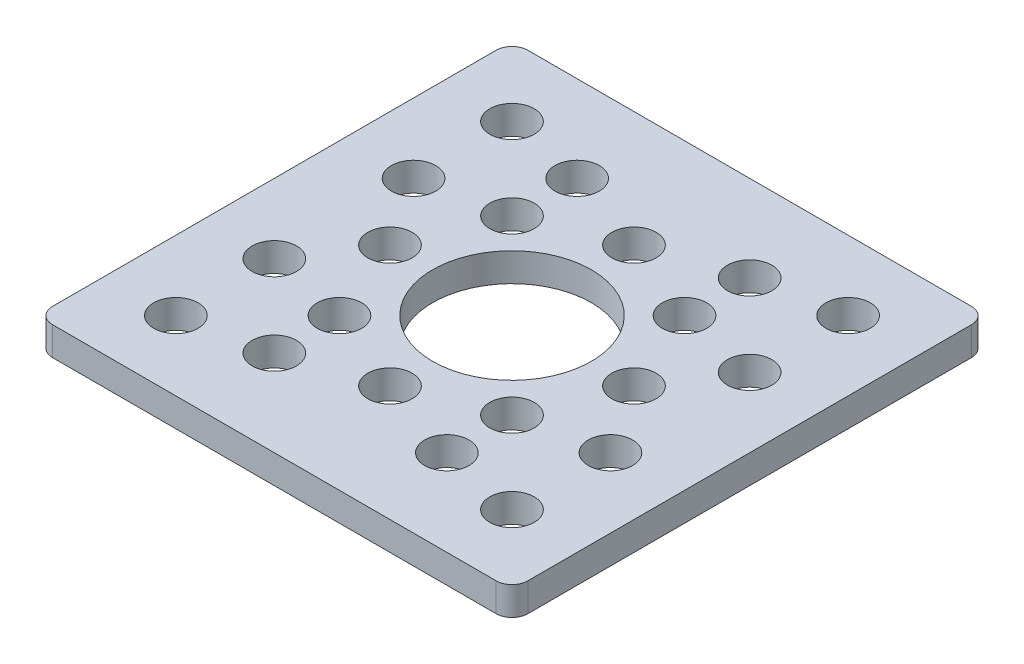
ISO-10303-21;
HEADER;
FILE_DESCRIPTION(('STEP AP214'),'2;1');
FILE_NAME('part.step','',(''),(''),'','','');
FILE_SCHEMA(('AUTOMOTIVE_DESIGN { 1 0 10303 214 1 1 1 1 }'));
ENDSEC;
DATA;
#1=APPLICATION_CONTEXT('core data for automotive mechanical design processes');
#2=APPLICATION_PROTOCOL_DEFINITION('international standard','automotive_design',2000,#1);
#3=PRODUCT_CONTEXT('',#1,'mechanical');
#4=PRODUCT('Part','Part','',(#3));
#5=PRODUCT_RELATED_PRODUCT_CATEGORY('part','',(#4));
#6=PRODUCT_DEFINITION_FORMATION('','',#4);
#7=PRODUCT_DEFINITION_CONTEXT('part definition',#1,'design');
#8=PRODUCT_DEFINITION('design','',#6,#7);
#9=PRODUCT_DEFINITION_SHAPE('','',#8);
#10=(LENGTH_UNIT() NAMED_UNIT(*) SI_UNIT(.MILLI.,.METRE.));
#11=(NAMED_UNIT(*) PLANE_ANGLE_UNIT() SI_UNIT($,.RADIAN.));
#12=(NAMED_UNIT(*) SI_UNIT($,.STERADIAN.) SOLID_ANGLE_UNIT());
#13=UNCERTAINTY_MEASURE_WITH_UNIT(LENGTH_MEASURE(1.E-05),#10,'distance_accuracy_value','');
#14=(GEOMETRIC_REPRESENTATION_CONTEXT(3) GLOBAL_UNCERTAINTY_ASSIGNED_CONTEXT((#13)) GLOBAL_UNIT_ASSIGNED_CONTEXT((#10,
#11,#12)) REPRESENTATION_CONTEXT('',''));
#15=CARTESIAN_POINT('',(0.,0.,0.));
#16=DIRECTION('',(0.,0.,1.));
#17=DIRECTION('',(1.,0.,0.));
#18=AXIS2_PLACEMENT_3D('',#15,#16,#17);
#19=CARTESIAN_POINT('',(0.,0.,0.));
#20=DIRECTION('',(0.,-1.,0.));
#21=DIRECTION('',(0.,0.,-1.));
#22=AXIS2_PLACEMENT_3D('',#19,#20,#21);
#23=PLANE('',#22);
#24=CARTESIAN_POINT('',(-13.4703841816038,0.,13.4703841816037));
#25=DIRECTION('',(0.,1.,0.));
#26=DIRECTION('',(0.,0.,1.));
#27=AXIS2_PLACEMENT_3D('',#24,#25,#26);
#28=CIRCLE('',#27,1.77799999999999);
#29=CARTESIAN_POINT('',(-13.4703841816038,0.,15.2483841816037));
#30=VERTEX_POINT('',#29);
#31=EDGE_CURVE('E192',#30,#30,#28,.T.);
#32=ORIENTED_EDGE('',*,*,#31,.T.);
#33=EDGE_LOOP('',(#32));
#34=FACE_BOUND('',#33,.T.);
#35=CARTESIAN_POINT('',(-13.4703841816037,0.,5.57961581839627));
#36=DIRECTION('',(0.,1.,0.));
#37=DIRECTION('',(0.,0.,1.));
#38=AXIS2_PLACEMENT_3D('',#35,#36,#37);
#39=CIRCLE('',#38,1.77799999999999);
#40=CARTESIAN_POINT('',(-13.4703841816037,0.,7.35761581839627));
#41=VERTEX_POINT('',#40);
#42=EDGE_CURVE('E195',#41,#41,#39,.T.);
#43=ORIENTED_EDGE('',*,*,#42,.T.);
#44=EDGE_LOOP('',(#43));
#45=FACE_BOUND('',#44,.T.);
#46=CARTESIAN_POINT('',(-6.91479721322325,0.,-12.1352027867768));
#47=DIRECTION('',(0.,1.,0.));
#48=DIRECTION('',(0.,0.,1.));
#49=AXIS2_PLACEMENT_3D('',#46,#47,#48);
#50=CIRCLE('',#49,1.77799999999999);
#51=CARTESIAN_POINT('',(-6.91479721322325,0.,-10.3572027867768));
#52=VERTEX_POINT('',#51);
#53=EDGE_CURVE('E198',#52,#52,#50,.T.);
#54=ORIENTED_EDGE('',*,*,#53,.T.);
#55=EDGE_LOOP('',(#54));
#56=FACE_BOUND('',#55,.T.);
#57=CARTESIAN_POINT('',(13.4703841816038,0.,-13.4703841816037));
#58=DIRECTION('',(0.,1.,0.));
#59=DIRECTION('',(0.,0.,1.));
#60=AXIS2_PLACEMENT_3D('',#57,#58,#59);
#61=CIRCLE('',#60,1.77799999999999);
#62=CARTESIAN_POINT('',(13.4703841816038,0.,-11.6923841816037));
#63=VERTEX_POINT('',#62);
#64=EDGE_CURVE('E246',#63,#63,#61,.T.);
#65=ORIENTED_EDGE('',*,*,#64,.T.);
#66=EDGE_LOOP('',(#65));
#67=FACE_BOUND('',#66,.T.);
#68=CARTESIAN_POINT('',(6.91479721322333,0.,6.91479721322316));
#69=DIRECTION('',(0.,1.,0.));
#70=DIRECTION('',(0.,0.,1.));
#71=AXIS2_PLACEMENT_3D('',#68,#69,#70);
#72=CIRCLE('',#71,1.778);
#73=CARTESIAN_POINT('',(6.91479721322333,0.,8.69279721322316));
#74=VERTEX_POINT('',#73);
#75=EDGE_CURVE('E109',#74,#74,#72,.T.);
#76=ORIENTED_EDGE('',*,*,#75,.T.);
#77=EDGE_LOOP('',(#76));
#78=FACE_BOUND('',#77,.T.);
#79=DIRECTION('',(1.,0.,0.));
#80=VECTOR('',#79,1.);
#81=CARTESIAN_POINT('',(-19.05,0.,-19.05));
#82=LINE('',#81,#80);
#83=CARTESIAN_POINT('',(-17.78,0.,-19.05));
#84=VERTEX_POINT('',#83);
#85=CARTESIAN_POINT('',(17.78,0.,-19.05));
#86=VERTEX_POINT('',#85);
#87=EDGE_CURVE('E115',#84,#86,#82,.T.);
#88=ORIENTED_EDGE('',*,*,#87,.T.);
#89=CARTESIAN_POINT('',(17.78,0.,-17.78));
#90=DIRECTION('',(0.,-1.,0.));
#91=DIRECTION('',(0.,0.,-1.));
#92=AXIS2_PLACEMENT_3D('',#89,#90,#91);
#93=CIRCLE('',#92,1.27);
#94=CARTESIAN_POINT('',(19.05,0.,-17.78));
#95=VERTEX_POINT('',#94);
#96=EDGE_CURVE('E116',#95,#86,#93,.F.);
#97=ORIENTED_EDGE('',*,*,#96,.F.);
#98=DIRECTION('',(0.,0.,1.));
#99=VECTOR('',#98,1.);
#100=CARTESIAN_POINT('',(19.05,0.,19.05));
#101=LINE('',#100,#99);
#102=CARTESIAN_POINT('',(19.05,0.,17.78));
#103=VERTEX_POINT('',#102);
#104=EDGE_CURVE('E110',#95,#103,#101,.T.);
#105=ORIENTED_EDGE('',*,*,#104,.T.);
#106=CARTESIAN_POINT('',(17.78,0.,17.78));
#107=DIRECTION('',(0.,-1.,0.));
#108=DIRECTION('',(0.,0.,-1.));
#109=AXIS2_PLACEMENT_3D('',#106,#107,#108);
#110=CIRCLE('',#109,1.27);
#111=CARTESIAN_POINT('',(17.78,0.,19.05));
#112=VERTEX_POINT('',#111);
#113=EDGE_CURVE('E113',#112,#103,#110,.F.);
#114=ORIENTED_EDGE('',*,*,#113,.F.);
#115=DIRECTION('',(-1.,0.,0.));
#116=VECTOR('',#115,1.);
#117=CARTESIAN_POINT('',(-19.05,0.,19.05));
#118=LINE('',#117,#116);
#119=CARTESIAN_POINT('',(-17.78,0.,19.05));
#120=VERTEX_POINT('',#119);
#121=EDGE_CURVE('E86',#112,#120,#118,.T.);
#122=ORIENTED_EDGE('',*,*,#121,.T.);
#123=CARTESIAN_POINT('',(-17.78,0.,17.78));
#124=DIRECTION('',(0.,-1.,0.));
#125=DIRECTION('',(0.,0.,-1.));
#126=AXIS2_PLACEMENT_3D('',#123,#124,#125);
#127=CIRCLE('',#126,1.27);
#128=CARTESIAN_POINT('',(-19.05,0.,17.78));
#129=VERTEX_POINT('',#128);
#130=EDGE_CURVE('E80',#129,#120,#127,.F.);
#131=ORIENTED_EDGE('',*,*,#130,.F.);
#132=DIRECTION('',(0.,0.,-1.));
#133=VECTOR('',#132,1.);
#134=CARTESIAN_POINT('',(-19.05,0.,19.05));
#135=LINE('',#134,#133);
#136=CARTESIAN_POINT('',(-19.05,0.,-17.78));
#137=VERTEX_POINT('',#136);
#138=EDGE_CURVE('E84',#129,#137,#135,.T.);
#139=ORIENTED_EDGE('',*,*,#138,.T.);
#140=CARTESIAN_POINT('',(-17.78,0.,-17.78));
#141=DIRECTION('',(0.,-1.,0.));
#142=DIRECTION('',(0.,0.,-1.));
#143=AXIS2_PLACEMENT_3D('',#140,#141,#142);
#144=CIRCLE('',#143,1.27);
#145=EDGE_CURVE('E99',#84,#137,#144,.F.);
#146=ORIENTED_EDGE('',*,*,#145,.F.);
#147=EDGE_LOOP('',(#88,#97,#105,#114,#122,#131,#139,#146));
#148=FACE_BOUND('',#147,.T.);
#149=CARTESIAN_POINT('',(0.,0.,0.));
#150=DIRECTION('',(0.,1.,0.));
#151=DIRECTION('',(0.,0.,1.));
#152=AXIS2_PLACEMENT_3D('',#149,#150,#151);
#153=CIRCLE('',#152,6.3627);
#154=CARTESIAN_POINT('',(0.,0.,6.3627));
#155=VERTEX_POINT('',#154);
#156=EDGE_CURVE('E92',#155,#155,#153,.T.);
#157=ORIENTED_EDGE('',*,*,#156,.T.);
#158=EDGE_LOOP('',(#157));
#159=FACE_BOUND('',#158,.T.);
#160=CARTESIAN_POINT('',(9.779,0.,0.));
#161=DIRECTION('',(0.,1.,0.));
#162=DIRECTION('',(0.,0.,1.));
#163=AXIS2_PLACEMENT_3D('',#160,#161,#162);
#164=CIRCLE('',#163,1.778);
#165=CARTESIAN_POINT('',(9.779,0.,1.778));
#166=VERTEX_POINT('',#165);
#167=EDGE_CURVE('E210',#166,#166,#164,.T.);
#168=ORIENTED_EDGE('',*,*,#167,.T.);
#169=EDGE_LOOP('',(#168));
#170=FACE_BOUND('',#169,.T.);
#171=CARTESIAN_POINT('',(6.91479721322324,0.,-6.91479721322326));
#172=DIRECTION('',(0.,1.,0.));
#173=DIRECTION('',(0.,0.,1.));
#174=AXIS2_PLACEMENT_3D('',#171,#172,#173);
#175=CIRCLE('',#174,1.778);
#176=CARTESIAN_POINT('',(6.91479721322324,0.,-5.13679721322326));
#177=VERTEX_POINT('',#176);
#178=EDGE_CURVE('E213',#177,#177,#175,.T.);
#179=ORIENTED_EDGE('',*,*,#178,.T.);
#180=EDGE_LOOP('',(#179));
#181=FACE_BOUND('',#180,.T.);
#182=CARTESIAN_POINT('',(0.,0.,-9.779));
#183=DIRECTION('',(0.,1.,0.));
#184=DIRECTION('',(0.,0.,1.));
#185=AXIS2_PLACEMENT_3D('',#182,#183,#184);
#186=CIRCLE('',#185,1.778);
#187=CARTESIAN_POINT('',(0.,0.,-8.001));
#188=VERTEX_POINT('',#187);
#189=EDGE_CURVE('E216',#188,#188,#186,.T.);
#190=ORIENTED_EDGE('',*,*,#189,.T.);
#191=EDGE_LOOP('',(#190));
#192=FACE_BOUND('',#191,.T.);
#193=CARTESIAN_POINT('',(-6.91479721322328,0.,-6.91479721322321));
#194=DIRECTION('',(0.,1.,0.));
#195=DIRECTION('',(0.,0.,1.));
#196=AXIS2_PLACEMENT_3D('',#193,#194,#195);
#197=CIRCLE('',#196,1.778);
#198=CARTESIAN_POINT('',(-6.91479721322328,0.,-5.13679721322321));
#199=VERTEX_POINT('',#198);
#200=EDGE_CURVE('E219',#199,#199,#197,.T.);
#201=ORIENTED_EDGE('',*,*,#200,.T.);
#202=EDGE_LOOP('',(#201));
#203=FACE_BOUND('',#202,.T.);
#204=CARTESIAN_POINT('',(-9.779,0.,0.));
#205=DIRECTION('',(0.,1.,0.));
#206=DIRECTION('',(0.,0.,1.));
#207=AXIS2_PLACEMENT_3D('',#204,#205,#206);
#208=CIRCLE('',#207,1.778);
#209=CARTESIAN_POINT('',(-9.779,0.,1.778));
#210=VERTEX_POINT('',#209);
#211=EDGE_CURVE('E222',#210,#210,#208,.T.);
#212=ORIENTED_EDGE('',*,*,#211,.T.);
#213=EDGE_LOOP('',(#212));
#214=FACE_BOUND('',#213,.T.);
#215=CARTESIAN_POINT('',(-6.91479721322319,0.,6.91479721322331));
#216=DIRECTION('',(0.,1.,0.));
#217=DIRECTION('',(0.,0.,1.));
#218=AXIS2_PLACEMENT_3D('',#215,#216,#217);
#219=CIRCLE('',#218,1.778);
#220=CARTESIAN_POINT('',(-6.91479721322319,0.,8.69279721322331));
#221=VERTEX_POINT('',#220);
#222=EDGE_CURVE('E225',#221,#221,#219,.T.);
#223=ORIENTED_EDGE('',*,*,#222,.T.);
#224=EDGE_LOOP('',(#223));
#225=FACE_BOUND('',#224,.T.);
#226=CARTESIAN_POINT('',(1.02429588037641E-13,0.,9.779));
#227=DIRECTION('',(0.,1.,0.));
#228=DIRECTION('',(0.,0.,1.));
#229=AXIS2_PLACEMENT_3D('',#226,#227,#228);
#230=CIRCLE('',#229,1.778);
#231=CARTESIAN_POINT('',(1.02429588037641E-13,0.,11.557));
#232=VERTEX_POINT('',#231);
#233=EDGE_CURVE('E228',#232,#232,#230,.T.);
#234=ORIENTED_EDGE('',*,*,#233,.T.);
#235=EDGE_LOOP('',(#234));
#236=FACE_BOUND('',#235,.T.);
#237=CARTESIAN_POINT('',(13.4703841816037,0.,5.57961581839627));
#238=DIRECTION('',(0.,1.,0.));
#239=DIRECTION('',(0.,0.,1.));
#240=AXIS2_PLACEMENT_3D('',#237,#238,#239);
#241=CIRCLE('',#240,1.77799999999999);
#242=CARTESIAN_POINT('',(13.4703841816037,0.,7.35761581839627));
#243=VERTEX_POINT('',#242);
#244=EDGE_CURVE('E231',#243,#243,#241,.T.);
#245=ORIENTED_EDGE('',*,*,#244,.T.);
#246=EDGE_LOOP('',(#245));
#247=FACE_BOUND('',#246,.T.);
#248=CARTESIAN_POINT('',(6.91479721322325,0.,12.1352027867768));
#249=DIRECTION('',(0.,1.,0.));
#250=DIRECTION('',(0.,0.,1.));
#251=AXIS2_PLACEMENT_3D('',#248,#249,#250);
#252=CIRCLE('',#251,1.77799999999999);
#253=CARTESIAN_POINT('',(6.91479721322325,0.,13.9132027867767));
#254=VERTEX_POINT('',#253);
#255=EDGE_CURVE('E234',#254,#254,#252,.T.);
#256=ORIENTED_EDGE('',*,*,#255,.T.);
#257=EDGE_LOOP('',(#256));
#258=FACE_BOUND('',#257,.T.);
#259=CARTESIAN_POINT('',(13.4703841816038,0.,13.4703841816037));
#260=DIRECTION('',(0.,1.,0.));
#261=DIRECTION('',(0.,0.,1.));
#262=AXIS2_PLACEMENT_3D('',#259,#260,#261);
#263=CIRCLE('',#262,1.77799999999999);
#264=CARTESIAN_POINT('',(13.4703841816038,0.,15.2483841816037));
#265=VERTEX_POINT('',#264);
#266=EDGE_CURVE('E237',#265,#265,#263,.T.);
#267=ORIENTED_EDGE('',*,*,#266,.T.);
#268=EDGE_LOOP('',(#267));
#269=FACE_BOUND('',#268,.T.);
#270=CARTESIAN_POINT('',(13.4703841816037,0.,-5.57961581839627));
#271=DIRECTION('',(0.,1.,0.));
#272=DIRECTION('',(0.,0.,1.));
#273=AXIS2_PLACEMENT_3D('',#270,#271,#272);
#274=CIRCLE('',#273,1.77799999999999);
#275=CARTESIAN_POINT('',(13.4703841816037,0.,-3.80161581839628));
#276=VERTEX_POINT('',#275);
#277=EDGE_CURVE('E240',#276,#276,#274,.T.);
#278=ORIENTED_EDGE('',*,*,#277,.T.);
#279=EDGE_LOOP('',(#278));
#280=FACE_BOUND('',#279,.T.);
#281=CARTESIAN_POINT('',(6.91479721322325,0.,-12.1352027867768));
#282=DIRECTION('',(0.,1.,0.));
#283=DIRECTION('',(0.,0.,1.));
#284=AXIS2_PLACEMENT_3D('',#281,#282,#283);
#285=CIRCLE('',#284,1.77799999999999);
#286=CARTESIAN_POINT('',(6.91479721322325,0.,-10.3572027867768));
#287=VERTEX_POINT('',#286);
#288=EDGE_CURVE('E243',#287,#287,#285,.T.);
#289=ORIENTED_EDGE('',*,*,#288,.T.);
#290=EDGE_LOOP('',(#289));
#291=FACE_BOUND('',#290,.T.);
#292=CARTESIAN_POINT('',(-13.4703841816037,0.,-5.57961581839627));
#293=DIRECTION('',(0.,1.,0.));
#294=DIRECTION('',(0.,0.,1.));
#295=AXIS2_PLACEMENT_3D('',#292,#293,#294);
#296=CIRCLE('',#295,1.77799999999999);
#297=CARTESIAN_POINT('',(-13.4703841816037,0.,-3.80161581839628));
#298=VERTEX_POINT('',#297);
#299=EDGE_CURVE('E249',#298,#298,#296,.T.);
#300=ORIENTED_EDGE('',*,*,#299,.T.);
#301=EDGE_LOOP('',(#300));
#302=FACE_BOUND('',#301,.T.);
#303=CARTESIAN_POINT('',(-13.4703841816038,0.,-13.4703841816037));
#304=DIRECTION('',(0.,1.,0.));
#305=DIRECTION('',(0.,0.,1.));
#306=AXIS2_PLACEMENT_3D('',#303,#304,#305);
#307=CIRCLE('',#306,1.77799999999999);
#308=CARTESIAN_POINT('',(-13.4703841816038,0.,-11.6923841816037));
#309=VERTEX_POINT('',#308);
#310=EDGE_CURVE('E251',#309,#309,#307,.T.);
#311=ORIENTED_EDGE('',*,*,#310,.T.);
#312=EDGE_LOOP('',(#311));
#313=FACE_BOUND('',#312,.T.);
#314=CARTESIAN_POINT('',(-6.91479721322325,0.,12.1352027867768));
#315=DIRECTION('',(0.,1.,0.));
#316=DIRECTION('',(0.,0.,1.));
#317=AXIS2_PLACEMENT_3D('',#314,#315,#316);
#318=CIRCLE('',#317,1.77799999999999);
#319=CARTESIAN_POINT('',(-6.91479721322325,0.,13.9132027867767));
#320=VERTEX_POINT('',#319);
#321=EDGE_CURVE('E19',#320,#320,#318,.T.);
#322=ORIENTED_EDGE('',*,*,#321,.T.);
#323=EDGE_LOOP('',(#322));
#324=FACE_BOUND('',#323,.T.);
#325=ADVANCED_FACE('F16',(#34,#45,#56,#67,#78,#148,#159,#170,#181,#192,#203,#214,#225,#236,#247,
#258,#269,#280,#291,#302,#313,#324),#23,.T.);
#326=CARTESIAN_POINT('',(-6.91479721322325,2.286,12.1352027867768));
#327=DIRECTION('',(0.,1.,0.));
#328=DIRECTION('',(0.,0.,1.));
#329=AXIS2_PLACEMENT_3D('',#326,#327,#328);
#330=CYLINDRICAL_SURFACE('',#329,1.77799999999999);
#331=ORIENTED_EDGE('',*,*,#321,.F.);
#332=EDGE_LOOP('',(#331));
#333=FACE_BOUND('',#332,.T.);
#334=CARTESIAN_POINT('',(-6.91479721322325,2.286,12.1352027867768));
#335=DIRECTION('',(0.,1.,0.));
#336=DIRECTION('',(0.,0.,1.));
#337=AXIS2_PLACEMENT_3D('',#334,#335,#336);
#338=CIRCLE('',#337,1.77799999999999);
#339=CARTESIAN_POINT('',(-6.91479721322325,2.286,13.9132027867767));
#340=VERTEX_POINT('',#339);
#341=EDGE_CURVE('E189',#340,#340,#338,.T.);
#342=ORIENTED_EDGE('',*,*,#341,.T.);
#343=EDGE_LOOP('',(#342));
#344=FACE_BOUND('',#343,.T.);
#345=ADVANCED_FACE('F259',(#333,#344),#330,.F.);
#346=CARTESIAN_POINT('',(-13.4703841816038,2.286,-13.4703841816037));
#347=DIRECTION('',(0.,1.,0.));
#348=DIRECTION('',(0.,0.,1.));
#349=AXIS2_PLACEMENT_3D('',#346,#347,#348);
#350=CYLINDRICAL_SURFACE('',#349,1.77799999999999);
#351=ORIENTED_EDGE('',*,*,#310,.F.);
#352=EDGE_LOOP('',(#351));
#353=FACE_BOUND('',#352,.T.);
#354=CARTESIAN_POINT('',(-13.4703841816038,2.286,-13.4703841816037));
#355=DIRECTION('',(0.,1.,0.));
#356=DIRECTION('',(0.,0.,1.));
#357=AXIS2_PLACEMENT_3D('',#354,#355,#356);
#358=CIRCLE('',#357,1.77799999999999);
#359=CARTESIAN_POINT('',(-13.4703841816038,2.286,-11.6923841816037));
#360=VERTEX_POINT('',#359);
#361=EDGE_CURVE('E186',#360,#360,#358,.T.);
#362=ORIENTED_EDGE('',*,*,#361,.T.);
#363=EDGE_LOOP('',(#362));
#364=FACE_BOUND('',#363,.T.);
#365=ADVANCED_FACE('F262',(#353,#364),#350,.F.);
#366=CARTESIAN_POINT('',(-13.4703841816037,2.286,-5.57961581839627));
#367=DIRECTION('',(0.,1.,0.));
#368=DIRECTION('',(0.,0.,1.));
#369=AXIS2_PLACEMENT_3D('',#366,#367,#368);
#370=CYLINDRICAL_SURFACE('',#369,1.77799999999999);
#371=ORIENTED_EDGE('',*,*,#299,.F.);
#372=EDGE_LOOP('',(#371));
#373=FACE_BOUND('',#372,.T.);
#374=CARTESIAN_POINT('',(-13.4703841816037,2.286,-5.57961581839627));
#375=DIRECTION('',(0.,1.,0.));
#376=DIRECTION('',(0.,0.,1.));
#377=AXIS2_PLACEMENT_3D('',#374,#375,#376);
#378=CIRCLE('',#377,1.77799999999999);
#379=CARTESIAN_POINT('',(-13.4703841816037,2.286,-3.80161581839628));
#380=VERTEX_POINT('',#379);
#381=EDGE_CURVE('E183',#380,#380,#378,.T.);
#382=ORIENTED_EDGE('',*,*,#381,.T.);
#383=EDGE_LOOP('',(#382));
#384=FACE_BOUND('',#383,.T.);
#385=ADVANCED_FACE('F373',(#373,#384),#370,.F.);
#386=CARTESIAN_POINT('',(13.4703841816038,2.286,-13.4703841816037));
#387=DIRECTION('',(0.,1.,0.));
#388=DIRECTION('',(0.,0.,1.));
#389=AXIS2_PLACEMENT_3D('',#386,#387,#388);
#390=CYLINDRICAL_SURFACE('',#389,1.77799999999999);
#391=ORIENTED_EDGE('',*,*,#64,.F.);
#392=EDGE_LOOP('',(#391));
#393=FACE_BOUND('',#392,.T.);
#394=CARTESIAN_POINT('',(13.4703841816038,2.286,-13.4703841816037));
#395=DIRECTION('',(0.,1.,0.));
#396=DIRECTION('',(0.,0.,1.));
#397=AXIS2_PLACEMENT_3D('',#394,#395,#396);
#398=CIRCLE('',#397,1.77799999999999);
#399=CARTESIAN_POINT('',(13.4703841816038,2.286,-11.6923841816037));
#400=VERTEX_POINT('',#399);
#401=EDGE_CURVE('E180',#400,#400,#398,.T.);
#402=ORIENTED_EDGE('',*,*,#401,.T.);
#403=EDGE_LOOP('',(#402));
#404=FACE_BOUND('',#403,.T.);
#405=ADVANCED_FACE('F369',(#393,#404),#390,.F.);
#406=CARTESIAN_POINT('',(6.91479721322325,2.286,-12.1352027867768));
#407=DIRECTION('',(0.,1.,0.));
#408=DIRECTION('',(0.,0.,1.));
#409=AXIS2_PLACEMENT_3D('',#406,#407,#408);
#410=CYLINDRICAL_SURFACE('',#409,1.77799999999999);
#411=ORIENTED_EDGE('',*,*,#288,.F.);
#412=EDGE_LOOP('',(#411));
#413=FACE_BOUND('',#412,.T.);
#414=CARTESIAN_POINT('',(6.91479721322325,2.286,-12.1352027867768));
#415=DIRECTION('',(0.,1.,0.));
#416=DIRECTION('',(0.,0.,1.));
#417=AXIS2_PLACEMENT_3D('',#414,#415,#416);
#418=CIRCLE('',#417,1.77799999999999);
#419=CARTESIAN_POINT('',(6.91479721322325,2.286,-10.3572027867768));
#420=VERTEX_POINT('',#419);
#421=EDGE_CURVE('E177',#420,#420,#418,.T.);
#422=ORIENTED_EDGE('',*,*,#421,.T.);
#423=EDGE_LOOP('',(#422));
#424=FACE_BOUND('',#423,.T.);
#425=ADVANCED_FACE('F365',(#413,#424),#410,.F.);
#426=CARTESIAN_POINT('',(13.4703841816037,2.286,-5.57961581839627));
#427=DIRECTION('',(0.,1.,0.));
#428=DIRECTION('',(0.,0.,1.));
#429=AXIS2_PLACEMENT_3D('',#426,#427,#428);
#430=CYLINDRICAL_SURFACE('',#429,1.77799999999999);
#431=ORIENTED_EDGE('',*,*,#277,.F.);
#432=EDGE_LOOP('',(#431));
#433=FACE_BOUND('',#432,.T.);
#434=CARTESIAN_POINT('',(13.4703841816037,2.286,-5.57961581839627));
#435=DIRECTION('',(0.,1.,0.));
#436=DIRECTION('',(0.,0.,1.));
#437=AXIS2_PLACEMENT_3D('',#434,#435,#436);
#438=CIRCLE('',#437,1.77799999999999);
#439=CARTESIAN_POINT('',(13.4703841816037,2.286,-3.80161581839628));
#440=VERTEX_POINT('',#439);
#441=EDGE_CURVE('E174',#440,#440,#438,.T.);
#442=ORIENTED_EDGE('',*,*,#441,.T.);
#443=EDGE_LOOP('',(#442));
#444=FACE_BOUND('',#443,.T.);
#445=ADVANCED_FACE('F361',(#433,#444),#430,.F.);
#446=CARTESIAN_POINT('',(13.4703841816038,2.286,13.4703841816037));
#447=DIRECTION('',(0.,1.,0.));
#448=DIRECTION('',(0.,0.,1.));
#449=AXIS2_PLACEMENT_3D('',#446,#447,#448);
#450=CYLINDRICAL_SURFACE('',#449,1.77799999999999);
#451=ORIENTED_EDGE('',*,*,#266,.F.);
#452=EDGE_LOOP('',(#451));
#453=FACE_BOUND('',#452,.T.);
#454=CARTESIAN_POINT('',(13.4703841816038,2.286,13.4703841816037));
#455=DIRECTION('',(0.,1.,0.));
#456=DIRECTION('',(0.,0.,1.));
#457=AXIS2_PLACEMENT_3D('',#454,#455,#456);
#458=CIRCLE('',#457,1.77799999999999);
#459=CARTESIAN_POINT('',(13.4703841816038,2.286,15.2483841816037));
#460=VERTEX_POINT('',#459);
#461=EDGE_CURVE('E171',#460,#460,#458,.T.);
#462=ORIENTED_EDGE('',*,*,#461,.T.);
#463=EDGE_LOOP('',(#462));
#464=FACE_BOUND('',#463,.T.);
#465=ADVANCED_FACE('F357',(#453,#464),#450,.F.);
#466=CARTESIAN_POINT('',(6.91479721322325,2.286,12.1352027867768));
#467=DIRECTION('',(0.,1.,0.));
#468=DIRECTION('',(0.,0.,1.));
#469=AXIS2_PLACEMENT_3D('',#466,#467,#468);
#470=CYLINDRICAL_SURFACE('',#469,1.77799999999999);
#471=ORIENTED_EDGE('',*,*,#255,.F.);
#472=EDGE_LOOP('',(#471));
#473=FACE_BOUND('',#472,.T.);
#474=CARTESIAN_POINT('',(6.91479721322325,2.286,12.1352027867768));
#475=DIRECTION('',(0.,1.,0.));
#476=DIRECTION('',(0.,0.,1.));
#477=AXIS2_PLACEMENT_3D('',#474,#475,#476);
#478=CIRCLE('',#477,1.77799999999999);
#479=CARTESIAN_POINT('',(6.91479721322325,2.286,13.9132027867767));
#480=VERTEX_POINT('',#479);
#481=EDGE_CURVE('E168',#480,#480,#478,.T.);
#482=ORIENTED_EDGE('',*,*,#481,.T.);
#483=EDGE_LOOP('',(#482));
#484=FACE_BOUND('',#483,.T.);
#485=ADVANCED_FACE('F353',(#473,#484),#470,.F.);
#486=CARTESIAN_POINT('',(13.4703841816037,2.286,5.57961581839627));
#487=DIRECTION('',(0.,1.,0.));
#488=DIRECTION('',(0.,0.,1.));
#489=AXIS2_PLACEMENT_3D('',#486,#487,#488);
#490=CYLINDRICAL_SURFACE('',#489,1.77799999999999);
#491=ORIENTED_EDGE('',*,*,#244,.F.);
#492=EDGE_LOOP('',(#491));
#493=FACE_BOUND('',#492,.T.);
#494=CARTESIAN_POINT('',(13.4703841816037,2.286,5.57961581839627));
#495=DIRECTION('',(0.,1.,0.));
#496=DIRECTION('',(0.,0.,1.));
#497=AXIS2_PLACEMENT_3D('',#494,#495,#496);
#498=CIRCLE('',#497,1.77799999999999);
#499=CARTESIAN_POINT('',(13.4703841816037,2.286,7.35761581839627));
#500=VERTEX_POINT('',#499);
#501=EDGE_CURVE('E165',#500,#500,#498,.T.);
#502=ORIENTED_EDGE('',*,*,#501,.T.);
#503=EDGE_LOOP('',(#502));
#504=FACE_BOUND('',#503,.T.);
#505=ADVANCED_FACE('F349',(#493,#504),#490,.F.);
#506=CARTESIAN_POINT('',(1.02429588037641E-13,2.286,9.779));
#507=DIRECTION('',(0.,1.,0.));
#508=DIRECTION('',(0.,0.,1.));
#509=AXIS2_PLACEMENT_3D('',#506,#507,#508);
#510=CYLINDRICAL_SURFACE('',#509,1.778);
#511=ORIENTED_EDGE('',*,*,#233,.F.);
#512=EDGE_LOOP('',(#511));
#513=FACE_BOUND('',#512,.T.);
#514=CARTESIAN_POINT('',(1.02429588037641E-13,2.286,9.779));
#515=DIRECTION('',(0.,1.,0.));
#516=DIRECTION('',(0.,0.,1.));
#517=AXIS2_PLACEMENT_3D('',#514,#515,#516);
#518=CIRCLE('',#517,1.778);
#519=CARTESIAN_POINT('',(1.02429588037641E-13,2.286,11.557));
#520=VERTEX_POINT('',#519);
#521=EDGE_CURVE('E162',#520,#520,#518,.T.);
#522=ORIENTED_EDGE('',*,*,#521,.T.);
#523=EDGE_LOOP('',(#522));
#524=FACE_BOUND('',#523,.T.);
#525=ADVANCED_FACE('F345',(#513,#524),#510,.F.);
#526=CARTESIAN_POINT('',(-6.91479721322319,2.286,6.91479721322331));
#527=DIRECTION('',(0.,1.,0.));
#528=DIRECTION('',(0.,0.,1.));
#529=AXIS2_PLACEMENT_3D('',#526,#527,#528);
#530=CYLINDRICAL_SURFACE('',#529,1.778);
#531=ORIENTED_EDGE('',*,*,#222,.F.);
#532=EDGE_LOOP('',(#531));
#533=FACE_BOUND('',#532,.T.);
#534=CARTESIAN_POINT('',(-6.91479721322319,2.286,6.91479721322331));
#535=DIRECTION('',(0.,1.,0.));
#536=DIRECTION('',(0.,0.,1.));
#537=AXIS2_PLACEMENT_3D('',#534,#535,#536);
#538=CIRCLE('',#537,1.778);
#539=CARTESIAN_POINT('',(-6.91479721322319,2.286,8.69279721322331));
#540=VERTEX_POINT('',#539);
#541=EDGE_CURVE('E159',#540,#540,#538,.T.);
#542=ORIENTED_EDGE('',*,*,#541,.T.);
#543=EDGE_LOOP('',(#542));
#544=FACE_BOUND('',#543,.T.);
#545=ADVANCED_FACE('F341',(#533,#544),#530,.F.);
#546=CARTESIAN_POINT('',(-9.779,2.286,0.));
#547=DIRECTION('',(0.,1.,0.));
#548=DIRECTION('',(0.,0.,1.));
#549=AXIS2_PLACEMENT_3D('',#546,#547,#548);
#550=CYLINDRICAL_SURFACE('',#549,1.778);
#551=ORIENTED_EDGE('',*,*,#211,.F.);
#552=EDGE_LOOP('',(#551));
#553=FACE_BOUND('',#552,.T.);
#554=CARTESIAN_POINT('',(-9.779,2.286,0.));
#555=DIRECTION('',(0.,1.,0.));
#556=DIRECTION('',(0.,0.,1.));
#557=AXIS2_PLACEMENT_3D('',#554,#555,#556);
#558=CIRCLE('',#557,1.778);
#559=CARTESIAN_POINT('',(-9.779,2.286,1.778));
#560=VERTEX_POINT('',#559);
#561=EDGE_CURVE('E156',#560,#560,#558,.T.);
#562=ORIENTED_EDGE('',*,*,#561,.T.);
#563=EDGE_LOOP('',(#562));
#564=FACE_BOUND('',#563,.T.);
#565=ADVANCED_FACE('F337',(#553,#564),#550,.F.);
#566=CARTESIAN_POINT('',(-6.91479721322328,2.286,-6.91479721322321));
#567=DIRECTION('',(0.,1.,0.));
#568=DIRECTION('',(0.,0.,1.));
#569=AXIS2_PLACEMENT_3D('',#566,#567,#568);
#570=CYLINDRICAL_SURFACE('',#569,1.778);
#571=ORIENTED_EDGE('',*,*,#200,.F.);
#572=EDGE_LOOP('',(#571));
#573=FACE_BOUND('',#572,.T.);
#574=CARTESIAN_POINT('',(-6.91479721322328,2.286,-6.91479721322321));
#575=DIRECTION('',(0.,1.,0.));
#576=DIRECTION('',(0.,0.,1.));
#577=AXIS2_PLACEMENT_3D('',#574,#575,#576);
#578=CIRCLE('',#577,1.778);
#579=CARTESIAN_POINT('',(-6.91479721322328,2.286,-5.13679721322321));
#580=VERTEX_POINT('',#579);
#581=EDGE_CURVE('E153',#580,#580,#578,.T.);
#582=ORIENTED_EDGE('',*,*,#581,.T.);
#583=EDGE_LOOP('',(#582));
#584=FACE_BOUND('',#583,.T.);
#585=ADVANCED_FACE('F333',(#573,#584),#570,.F.);
#586=CARTESIAN_POINT('',(0.,2.286,-9.779));
#587=DIRECTION('',(0.,1.,0.));
#588=DIRECTION('',(0.,0.,1.));
#589=AXIS2_PLACEMENT_3D('',#586,#587,#588);
#590=CYLINDRICAL_SURFACE('',#589,1.778);
#591=ORIENTED_EDGE('',*,*,#189,.F.);
#592=EDGE_LOOP('',(#591));
#593=FACE_BOUND('',#592,.T.);
#594=CARTESIAN_POINT('',(0.,2.286,-9.779));
#595=DIRECTION('',(0.,1.,0.));
#596=DIRECTION('',(0.,0.,1.));
#597=AXIS2_PLACEMENT_3D('',#594,#595,#596);
#598=CIRCLE('',#597,1.778);
#599=CARTESIAN_POINT('',(0.,2.286,-8.001));
#600=VERTEX_POINT('',#599);
#601=EDGE_CURVE('E150',#600,#600,#598,.T.);
#602=ORIENTED_EDGE('',*,*,#601,.T.);
#603=EDGE_LOOP('',(#602));
#604=FACE_BOUND('',#603,.T.);
#605=ADVANCED_FACE('F329',(#593,#604),#590,.F.);
#606=CARTESIAN_POINT('',(6.91479721322324,2.286,-6.91479721322326));
#607=DIRECTION('',(0.,1.,0.));
#608=DIRECTION('',(0.,0.,1.));
#609=AXIS2_PLACEMENT_3D('',#606,#607,#608);
#610=CYLINDRICAL_SURFACE('',#609,1.778);
#611=ORIENTED_EDGE('',*,*,#178,.F.);
#612=EDGE_LOOP('',(#611));
#613=FACE_BOUND('',#612,.T.);
#614=CARTESIAN_POINT('',(6.91479721322324,2.286,-6.91479721322326));
#615=DIRECTION('',(0.,1.,0.));
#616=DIRECTION('',(0.,0.,1.));
#617=AXIS2_PLACEMENT_3D('',#614,#615,#616);
#618=CIRCLE('',#617,1.778);
#619=CARTESIAN_POINT('',(6.91479721322324,2.286,-5.13679721322326));
#620=VERTEX_POINT('',#619);
#621=EDGE_CURVE('E147',#620,#620,#618,.T.);
#622=ORIENTED_EDGE('',*,*,#621,.T.);
#623=EDGE_LOOP('',(#622));
#624=FACE_BOUND('',#623,.T.);
#625=ADVANCED_FACE('F325',(#613,#624),#610,.F.);
#626=CARTESIAN_POINT('',(9.779,2.286,0.));
#627=DIRECTION('',(0.,1.,0.));
#628=DIRECTION('',(0.,0.,1.));
#629=AXIS2_PLACEMENT_3D('',#626,#627,#628);
#630=CYLINDRICAL_SURFACE('',#629,1.778);
#631=ORIENTED_EDGE('',*,*,#167,.F.);
#632=EDGE_LOOP('',(#631));
#633=FACE_BOUND('',#632,.T.);
#634=CARTESIAN_POINT('',(9.779,2.286,0.));
#635=DIRECTION('',(0.,1.,0.));
#636=DIRECTION('',(0.,0.,1.));
#637=AXIS2_PLACEMENT_3D('',#634,#635,#636);
#638=CIRCLE('',#637,1.778);
#639=CARTESIAN_POINT('',(9.779,2.286,1.778));
#640=VERTEX_POINT('',#639);
#641=EDGE_CURVE('E144',#640,#640,#638,.T.);
#642=ORIENTED_EDGE('',*,*,#641,.T.);
#643=EDGE_LOOP('',(#642));
#644=FACE_BOUND('',#643,.T.);
#645=ADVANCED_FACE('F321',(#633,#644),#630,.F.);
#646=CARTESIAN_POINT('',(0.,2.286,0.));
#647=DIRECTION('',(0.,1.,0.));
#648=DIRECTION('',(0.,0.,1.));
#649=AXIS2_PLACEMENT_3D('',#646,#647,#648);
#650=CYLINDRICAL_SURFACE('',#649,6.3627);
#651=ORIENTED_EDGE('',*,*,#156,.F.);
#652=EDGE_LOOP('',(#651));
#653=FACE_BOUND('',#652,.T.);
#654=CARTESIAN_POINT('',(0.,2.286,0.));
#655=DIRECTION('',(0.,1.,0.));
#656=DIRECTION('',(0.,0.,1.));
#657=AXIS2_PLACEMENT_3D('',#654,#655,#656);
#658=CIRCLE('',#657,6.3627);
#659=CARTESIAN_POINT('',(0.,2.286,6.3627));
#660=VERTEX_POINT('',#659);
#661=EDGE_CURVE('E141',#660,#660,#658,.T.);
#662=ORIENTED_EDGE('',*,*,#661,.T.);
#663=EDGE_LOOP('',(#662));
#664=FACE_BOUND('',#663,.T.);
#665=ADVANCED_FACE('F318',(#653,#664),#650,.F.);
#666=CARTESIAN_POINT('',(-17.78,2.286,17.78));
#667=DIRECTION('',(0.,-1.,0.));
#668=DIRECTION('',(0.,0.,-1.));
#669=AXIS2_PLACEMENT_3D('',#666,#667,#668);
#670=CYLINDRICAL_SURFACE('',#669,1.27);
#671=ORIENTED_EDGE('',*,*,#130,.T.);
#672=DIRECTION('',(0.,1.,0.));
#673=VECTOR('',#672,1.);
#674=CARTESIAN_POINT('',(-17.78,2.286,19.05));
#675=LINE('',#674,#673);
#676=CARTESIAN_POINT('',(-17.78,2.286,19.05));
#677=VERTEX_POINT('',#676);
#678=EDGE_CURVE('E679',#120,#677,#675,.T.);
#679=ORIENTED_EDGE('',*,*,#678,.T.);
#680=CARTESIAN_POINT('',(-17.78,2.286,17.78));
#681=DIRECTION('',(0.,-1.,0.));
#682=DIRECTION('',(0.,0.,-1.));
#683=AXIS2_PLACEMENT_3D('',#680,#681,#682);
#684=CIRCLE('',#683,1.27);
#685=CARTESIAN_POINT('',(-19.05,2.286,17.78));
#686=VERTEX_POINT('',#685);
#687=EDGE_CURVE('E103',#677,#686,#684,.T.);
#688=ORIENTED_EDGE('',*,*,#687,.T.);
#689=DIRECTION('',(0.,1.,0.));
#690=VECTOR('',#689,1.);
#691=CARTESIAN_POINT('',(-19.05,2.286,17.78));
#692=LINE('',#691,#690);
#693=EDGE_CURVE('E91',#686,#129,#692,.F.);
#694=ORIENTED_EDGE('',*,*,#693,.T.);
#695=EDGE_LOOP('',(#671,#679,#688,#694));
#696=FACE_BOUND('',#695,.T.);
#697=ADVANCED_FACE('F102',(#696),#670,.T.);
#698=CARTESIAN_POINT('',(-19.05,2.286,19.05));
#699=DIRECTION('',(1.,0.,0.));
#700=DIRECTION('',(0.,0.,-1.));
#701=AXIS2_PLACEMENT_3D('',#698,#699,#700);
#702=PLANE('',#701);
#703=ORIENTED_EDGE('',*,*,#693,.F.);
#704=DIRECTION('',(0.,0.,-1.));
#705=VECTOR('',#704,1.);
#706=CARTESIAN_POINT('',(-19.05,2.286,0.));
#707=LINE('',#706,#705);
#708=CARTESIAN_POINT('',(-19.05,2.286,-17.78));
#709=VERTEX_POINT('',#708);
#710=EDGE_CURVE('E139',#686,#709,#707,.T.);
#711=ORIENTED_EDGE('',*,*,#710,.T.);
#712=DIRECTION('',(0.,-1.,0.));
#713=VECTOR('',#712,1.);
#714=CARTESIAN_POINT('',(-19.05,2.286,-17.78));
#715=LINE('',#714,#713);
#716=EDGE_CURVE('E98',#137,#709,#715,.F.);
#717=ORIENTED_EDGE('',*,*,#716,.F.);
#718=ORIENTED_EDGE('',*,*,#138,.F.);
#719=EDGE_LOOP('',(#703,#711,#717,#718));
#720=FACE_BOUND('',#719,.T.);
#721=ADVANCED_FACE('F95',(#720),#702,.F.);
#722=CARTESIAN_POINT('',(-17.78,2.286,-17.78));
#723=DIRECTION('',(0.,-1.,0.));
#724=DIRECTION('',(0.,0.,-1.));
#725=AXIS2_PLACEMENT_3D('',#722,#723,#724);
#726=CYLINDRICAL_SURFACE('',#725,1.27);
#727=ORIENTED_EDGE('',*,*,#145,.T.);
#728=ORIENTED_EDGE('',*,*,#716,.T.);
#729=CARTESIAN_POINT('',(-17.78,2.286,-17.78));
#730=DIRECTION('',(0.,-1.,0.));
#731=DIRECTION('',(0.,0.,-1.));
#732=AXIS2_PLACEMENT_3D('',#729,#730,#731);
#733=CIRCLE('',#732,1.27);
#734=CARTESIAN_POINT('',(-17.78,2.286,-19.05));
#735=VERTEX_POINT('',#734);
#736=EDGE_CURVE('E136',#709,#735,#733,.T.);
#737=ORIENTED_EDGE('',*,*,#736,.T.);
#738=DIRECTION('',(0.,1.,0.));
#739=VECTOR('',#738,1.);
#740=CARTESIAN_POINT('',(-17.78,2.286,-19.05));
#741=LINE('',#740,#739);
#742=EDGE_CURVE('E117',#735,#84,#741,.F.);
#743=ORIENTED_EDGE('',*,*,#742,.T.);
#744=EDGE_LOOP('',(#727,#728,#737,#743));
#745=FACE_BOUND('',#744,.T.);
#746=ADVANCED_FACE('F309',(#745),#726,.T.);
#747=CARTESIAN_POINT('',(-19.05,2.286,-19.05));
#748=DIRECTION('',(0.,0.,1.));
#749=DIRECTION('',(1.,0.,0.));
#750=AXIS2_PLACEMENT_3D('',#747,#748,#749);
#751=PLANE('',#750);
#752=DIRECTION('',(0.,-1.,0.));
#753=VECTOR('',#752,1.);
#754=CARTESIAN_POINT('',(17.78,2.286,-19.05));
#755=LINE('',#754,#753);
#756=CARTESIAN_POINT('',(17.78,2.286,-19.05));
#757=VERTEX_POINT('',#756);
#758=EDGE_CURVE('E206',#86,#757,#755,.F.);
#759=ORIENTED_EDGE('',*,*,#758,.F.);
#760=ORIENTED_EDGE('',*,*,#87,.F.);
#761=ORIENTED_EDGE('',*,*,#742,.F.);
#762=DIRECTION('',(1.,0.,0.));
#763=VECTOR('',#762,1.);
#764=CARTESIAN_POINT('',(0.,2.286,-19.05));
#765=LINE('',#764,#763);
#766=EDGE_CURVE('E135',#735,#757,#765,.T.);
#767=ORIENTED_EDGE('',*,*,#766,.T.);
#768=EDGE_LOOP('',(#759,#760,#761,#767));
#769=FACE_BOUND('',#768,.T.);
#770=ADVANCED_FACE('F305',(#769),#751,.F.);
#771=CARTESIAN_POINT('',(17.78,2.286,-17.78));
#772=DIRECTION('',(0.,-1.,0.));
#773=DIRECTION('',(0.,0.,-1.));
#774=AXIS2_PLACEMENT_3D('',#771,#772,#773);
#775=CYLINDRICAL_SURFACE('',#774,1.27);
#776=ORIENTED_EDGE('',*,*,#96,.T.);
#777=ORIENTED_EDGE('',*,*,#758,.T.);
#778=CARTESIAN_POINT('',(17.78,2.286,-17.78));
#779=DIRECTION('',(0.,-1.,0.));
#780=DIRECTION('',(0.,0.,-1.));
#781=AXIS2_PLACEMENT_3D('',#778,#779,#780);
#782=CIRCLE('',#781,1.27);
#783=CARTESIAN_POINT('',(19.05,2.286,-17.78));
#784=VERTEX_POINT('',#783);
#785=EDGE_CURVE('E132',#757,#784,#782,.T.);
#786=ORIENTED_EDGE('',*,*,#785,.T.);
#787=DIRECTION('',(0.,1.,0.));
#788=VECTOR('',#787,1.);
#789=CARTESIAN_POINT('',(19.05,2.286,-17.78));
#790=LINE('',#789,#788);
#791=EDGE_CURVE('E114',#784,#95,#790,.F.);
#792=ORIENTED_EDGE('',*,*,#791,.T.);
#793=EDGE_LOOP('',(#776,#777,#786,#792));
#794=FACE_BOUND('',#793,.T.);
#795=ADVANCED_FACE('F301',(#794),#775,.T.);
#796=CARTESIAN_POINT('',(19.05,2.286,19.05));
#797=DIRECTION('',(-1.,0.,0.));
#798=DIRECTION('',(0.,0.,1.));
#799=AXIS2_PLACEMENT_3D('',#796,#797,#798);
#800=PLANE('',#799);
#801=DIRECTION('',(0.,-1.,0.));
#802=VECTOR('',#801,1.);
#803=CARTESIAN_POINT('',(19.05,2.286,17.78));
#804=LINE('',#803,#802);
#805=CARTESIAN_POINT('',(19.05,2.286,17.78));
#806=VERTEX_POINT('',#805);
#807=EDGE_CURVE('E204',#103,#806,#804,.F.);
#808=ORIENTED_EDGE('',*,*,#807,.F.);
#809=ORIENTED_EDGE('',*,*,#104,.F.);
#810=ORIENTED_EDGE('',*,*,#791,.F.);
#811=DIRECTION('',(0.,0.,-1.));
#812=VECTOR('',#811,1.);
#813=CARTESIAN_POINT('',(19.05,2.286,0.));
#814=LINE('',#813,#812);
#815=EDGE_CURVE('E131',#784,#806,#814,.F.);
#816=ORIENTED_EDGE('',*,*,#815,.T.);
#817=EDGE_LOOP('',(#808,#809,#810,#816));
#818=FACE_BOUND('',#817,.T.);
#819=ADVANCED_FACE('F297',(#818),#800,.F.);
#820=CARTESIAN_POINT('',(17.78,2.286,17.78));
#821=DIRECTION('',(0.,-1.,0.));
#822=DIRECTION('',(0.,0.,-1.));
#823=AXIS2_PLACEMENT_3D('',#820,#821,#822);
#824=CYLINDRICAL_SURFACE('',#823,1.27);
#825=ORIENTED_EDGE('',*,*,#113,.T.);
#826=ORIENTED_EDGE('',*,*,#807,.T.);
#827=CARTESIAN_POINT('',(17.78,2.286,17.78));
#828=DIRECTION('',(0.,-1.,0.));
#829=DIRECTION('',(0.,0.,-1.));
#830=AXIS2_PLACEMENT_3D('',#827,#828,#829);
#831=CIRCLE('',#830,1.27);
#832=CARTESIAN_POINT('',(17.78,2.286,19.05));
#833=VERTEX_POINT('',#832);
#834=EDGE_CURVE('E128',#806,#833,#831,.T.);
#835=ORIENTED_EDGE('',*,*,#834,.T.);
#836=DIRECTION('',(0.,1.,0.));
#837=VECTOR('',#836,1.);
#838=CARTESIAN_POINT('',(17.78,2.286,19.05));
#839=LINE('',#838,#837);
#840=EDGE_CURVE('E34',#833,#112,#839,.F.);
#841=ORIENTED_EDGE('',*,*,#840,.T.);
#842=EDGE_LOOP('',(#825,#826,#835,#841));
#843=FACE_BOUND('',#842,.T.);
#844=ADVANCED_FACE('F294',(#843),#824,.T.);
#845=CARTESIAN_POINT('',(-19.05,2.286,19.05));
#846=DIRECTION('',(0.,0.,-1.));
#847=DIRECTION('',(-1.,0.,0.));
#848=AXIS2_PLACEMENT_3D('',#845,#846,#847);
#849=PLANE('',#848);
#850=ORIENTED_EDGE('',*,*,#840,.F.);
#851=DIRECTION('',(1.,0.,0.));
#852=VECTOR('',#851,1.);
#853=CARTESIAN_POINT('',(0.,2.286,19.05));
#854=LINE('',#853,#852);
#855=EDGE_CURVE('E127',#833,#677,#854,.F.);
#856=ORIENTED_EDGE('',*,*,#855,.T.);
#857=ORIENTED_EDGE('',*,*,#678,.F.);
#858=ORIENTED_EDGE('',*,*,#121,.F.);
#859=EDGE_LOOP('',(#850,#856,#857,#858));
#860=FACE_BOUND('',#859,.T.);
#861=ADVANCED_FACE('F290',(#860),#849,.F.);
#862=CARTESIAN_POINT('',(6.91479721322333,2.286,6.91479721322316));
#863=DIRECTION('',(0.,1.,0.));
#864=DIRECTION('',(0.,0.,1.));
#865=AXIS2_PLACEMENT_3D('',#862,#863,#864);
#866=CYLINDRICAL_SURFACE('',#865,1.778);
#867=ORIENTED_EDGE('',*,*,#75,.F.);
#868=EDGE_LOOP('',(#867));
#869=FACE_BOUND('',#868,.T.);
#870=CARTESIAN_POINT('',(6.91479721322333,2.286,6.91479721322316));
#871=DIRECTION('',(0.,1.,0.));
#872=DIRECTION('',(0.,0.,1.));
#873=AXIS2_PLACEMENT_3D('',#870,#871,#872);
#874=CIRCLE('',#873,1.778);
#875=CARTESIAN_POINT('',(6.91479721322333,2.286,8.69279721322316));
#876=VERTEX_POINT('',#875);
#877=EDGE_CURVE('E124',#876,#876,#874,.T.);
#878=ORIENTED_EDGE('',*,*,#877,.T.);
#879=EDGE_LOOP('',(#878));
#880=FACE_BOUND('',#879,.T.);
#881=ADVANCED_FACE('F286',(#869,#880),#866,.F.);
#882=CARTESIAN_POINT('',(-6.91479721322325,2.286,-12.1352027867768));
#883=DIRECTION('',(0.,1.,0.));
#884=DIRECTION('',(0.,0.,1.));
#885=AXIS2_PLACEMENT_3D('',#882,#883,#884);
#886=CYLINDRICAL_SURFACE('',#885,1.77799999999999);
#887=ORIENTED_EDGE('',*,*,#53,.F.);
#888=EDGE_LOOP('',(#887));
#889=FACE_BOUND('',#888,.T.);
#890=CARTESIAN_POINT('',(-6.91479721322325,2.286,-12.1352027867768));
#891=DIRECTION('',(0.,1.,0.));
#892=DIRECTION('',(0.,0.,1.));
#893=AXIS2_PLACEMENT_3D('',#890,#891,#892);
#894=CIRCLE('',#893,1.77799999999999);
#895=CARTESIAN_POINT('',(-6.91479721322325,2.286,-10.3572027867768));
#896=VERTEX_POINT('',#895);
#897=EDGE_CURVE('E121',#896,#896,#894,.T.);
#898=ORIENTED_EDGE('',*,*,#897,.T.);
#899=EDGE_LOOP('',(#898));
#900=FACE_BOUND('',#899,.T.);
#901=ADVANCED_FACE('F282',(#889,#900),#886,.F.);
#902=CARTESIAN_POINT('',(-13.4703841816037,2.286,5.57961581839627));
#903=DIRECTION('',(0.,1.,0.));
#904=DIRECTION('',(0.,0.,1.));
#905=AXIS2_PLACEMENT_3D('',#902,#903,#904);
#906=CYLINDRICAL_SURFACE('',#905,1.77799999999999);
#907=ORIENTED_EDGE('',*,*,#42,.F.);
#908=EDGE_LOOP('',(#907));
#909=FACE_BOUND('',#908,.T.);
#910=CARTESIAN_POINT('',(-13.4703841816037,2.286,5.57961581839627));
#911=DIRECTION('',(0.,1.,0.));
#912=DIRECTION('',(0.,0.,1.));
#913=AXIS2_PLACEMENT_3D('',#910,#911,#912);
#914=CIRCLE('',#913,1.77799999999999);
#915=CARTESIAN_POINT('',(-13.4703841816037,2.286,7.35761581839627));
#916=VERTEX_POINT('',#915);
#917=EDGE_CURVE('E25',#916,#916,#914,.T.);
#918=ORIENTED_EDGE('',*,*,#917,.T.);
#919=EDGE_LOOP('',(#918));
#920=FACE_BOUND('',#919,.T.);
#921=ADVANCED_FACE('F274',(#909,#920),#906,.F.);
#922=CARTESIAN_POINT('',(-13.4703841816038,2.286,13.4703841816037));
#923=DIRECTION('',(0.,1.,0.));
#924=DIRECTION('',(0.,0.,1.));
#925=AXIS2_PLACEMENT_3D('',#922,#923,#924);
#926=CYLINDRICAL_SURFACE('',#925,1.77799999999999);
#927=ORIENTED_EDGE('',*,*,#31,.F.);
#928=EDGE_LOOP('',(#927));
#929=FACE_BOUND('',#928,.T.);
#930=CARTESIAN_POINT('',(-13.4703841816038,2.286,13.4703841816037));
#931=DIRECTION('',(0.,1.,0.));
#932=DIRECTION('',(0.,0.,1.));
#933=AXIS2_PLACEMENT_3D('',#930,#931,#932);
#934=CIRCLE('',#933,1.77799999999999);
#935=CARTESIAN_POINT('',(-13.4703841816038,2.286,15.2483841816037));
#936=VERTEX_POINT('',#935);
#937=EDGE_CURVE('E11',#936,#936,#934,.T.);
#938=ORIENTED_EDGE('',*,*,#937,.T.);
#939=EDGE_LOOP('',(#938));
#940=FACE_BOUND('',#939,.T.);
#941=ADVANCED_FACE('F267',(#929,#940),#926,.F.);
#942=CARTESIAN_POINT('',(0.,2.286,0.));
#943=DIRECTION('',(0.,-1.,0.));
#944=DIRECTION('',(0.,0.,-1.));
#945=AXIS2_PLACEMENT_3D('',#942,#943,#944);
#946=PLANE('',#945);
#947=ORIENTED_EDGE('',*,*,#937,.F.);
#948=EDGE_LOOP('',(#947));
#949=FACE_BOUND('',#948,.T.);
#950=ORIENTED_EDGE('',*,*,#917,.F.);
#951=EDGE_LOOP('',(#950));
#952=FACE_BOUND('',#951,.T.);
#953=ORIENTED_EDGE('',*,*,#897,.F.);
#954=EDGE_LOOP('',(#953));
#955=FACE_BOUND('',#954,.T.);
#956=ORIENTED_EDGE('',*,*,#877,.F.);
#957=EDGE_LOOP('',(#956));
#958=FACE_BOUND('',#957,.T.);
#959=ORIENTED_EDGE('',*,*,#834,.F.);
#960=ORIENTED_EDGE('',*,*,#815,.F.);
#961=ORIENTED_EDGE('',*,*,#785,.F.);
#962=ORIENTED_EDGE('',*,*,#766,.F.);
#963=ORIENTED_EDGE('',*,*,#736,.F.);
#964=ORIENTED_EDGE('',*,*,#710,.F.);
#965=ORIENTED_EDGE('',*,*,#687,.F.);
#966=ORIENTED_EDGE('',*,*,#855,.F.);
#967=EDGE_LOOP('',(#959,#960,#961,#962,#963,#964,#965,#966));
#968=FACE_BOUND('',#967,.T.);
#969=ORIENTED_EDGE('',*,*,#661,.F.);
#970=EDGE_LOOP('',(#969));
#971=FACE_BOUND('',#970,.T.);
#972=ORIENTED_EDGE('',*,*,#641,.F.);
#973=EDGE_LOOP('',(#972));
#974=FACE_BOUND('',#973,.T.);
#975=ORIENTED_EDGE('',*,*,#621,.F.);
#976=EDGE_LOOP('',(#975));
#977=FACE_BOUND('',#976,.T.);
#978=ORIENTED_EDGE('',*,*,#601,.F.);
#979=EDGE_LOOP('',(#978));
#980=FACE_BOUND('',#979,.T.);
#981=ORIENTED_EDGE('',*,*,#581,.F.);
#982=EDGE_LOOP('',(#981));
#983=FACE_BOUND('',#982,.T.);
#984=ORIENTED_EDGE('',*,*,#561,.F.);
#985=EDGE_LOOP('',(#984));
#986=FACE_BOUND('',#985,.T.);
#987=ORIENTED_EDGE('',*,*,#541,.F.);
#988=EDGE_LOOP('',(#987));
#989=FACE_BOUND('',#988,.T.);
#990=ORIENTED_EDGE('',*,*,#521,.F.);
#991=EDGE_LOOP('',(#990));
#992=FACE_BOUND('',#991,.T.);
#993=ORIENTED_EDGE('',*,*,#501,.F.);
#994=EDGE_LOOP('',(#993));
#995=FACE_BOUND('',#994,.T.);
#996=ORIENTED_EDGE('',*,*,#481,.F.);
#997=EDGE_LOOP('',(#996));
#998=FACE_BOUND('',#997,.T.);
#999=ORIENTED_EDGE('',*,*,#461,.F.);
#1000=EDGE_LOOP('',(#999));
#1001=FACE_BOUND('',#1000,.T.);
#1002=ORIENTED_EDGE('',*,*,#441,.F.);
#1003=EDGE_LOOP('',(#1002));
#1004=FACE_BOUND('',#1003,.T.);
#1005=ORIENTED_EDGE('',*,*,#421,.F.);
#1006=EDGE_LOOP('',(#1005));
#1007=FACE_BOUND('',#1006,.T.);
#1008=ORIENTED_EDGE('',*,*,#401,.F.);
#1009=EDGE_LOOP('',(#1008));
#1010=FACE_BOUND('',#1009,.T.);
#1011=ORIENTED_EDGE('',*,*,#381,.F.);
#1012=EDGE_LOOP('',(#1011));
#1013=FACE_BOUND('',#1012,.T.);
#1014=ORIENTED_EDGE('',*,*,#361,.F.);
#1015=EDGE_LOOP('',(#1014));
#1016=FACE_BOUND('',#1015,.T.);
#1017=ORIENTED_EDGE('',*,*,#341,.F.);
#1018=EDGE_LOOP('',(#1017));
#1019=FACE_BOUND('',#1018,.T.);
#1020=ADVANCED_FACE('F265',(#949,#952,#955,#958,#968,#971,#974,#977,#980,#983,#986,#989,#992,
#995,#998,#1001,#1004,#1007,#1010,#1013,#1016,#1019),#946,.F.);
#1021=CLOSED_SHELL('',(#325,#345,#365,#385,#405,#425,#445,#465,#485,#505,#525,#545,#565,#585,
#605,#625,#645,#665,#697,#721,#746,#770,#795,#819,#844,#861,#881,#901,#921,#941,#1020));
#1022=MANIFOLD_SOLID_BREP('B1',#1021);
#1023=ADVANCED_BREP_SHAPE_REPRESENTATION('',(#18,#1022),#14);
#1024=SHAPE_DEFINITION_REPRESENTATION(#9,#1023);
ENDSEC;
END-ISO-10303-21;
